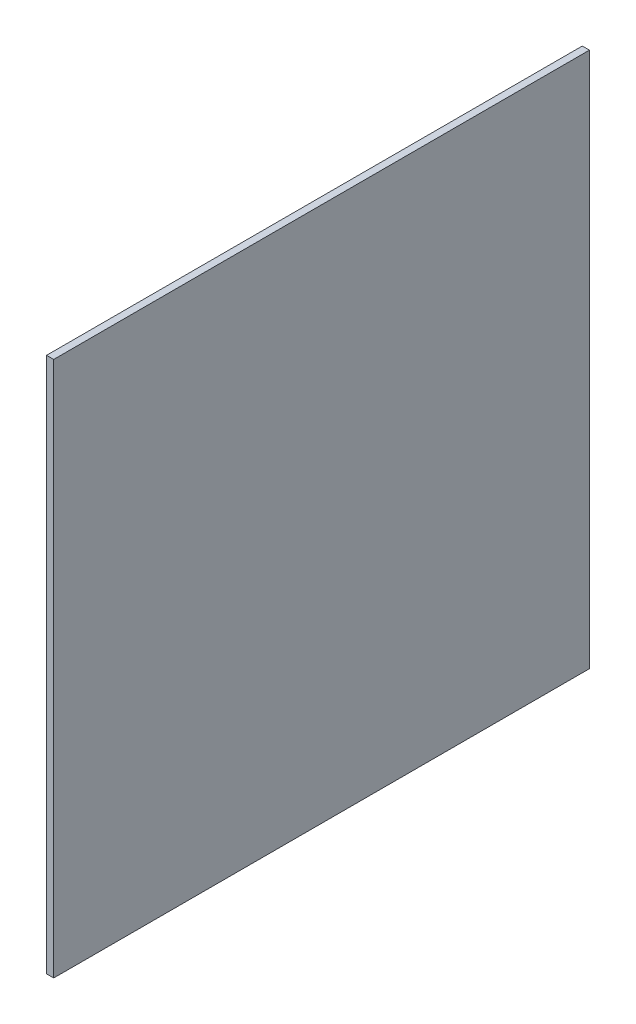
ISO-10303-21;
HEADER;
FILE_DESCRIPTION(('STEP AP214'),'2;1');
FILE_NAME('part.step','',(''),(''),'','','');
FILE_SCHEMA(('AUTOMOTIVE_DESIGN { 1 0 10303 214 1 1 1 1 }'));
ENDSEC;
DATA;
#1=APPLICATION_CONTEXT('core data for automotive mechanical design processes');
#2=APPLICATION_PROTOCOL_DEFINITION('international standard','automotive_design',2000,#1);
#3=PRODUCT_CONTEXT('',#1,'mechanical');
#4=PRODUCT('Part','Part','',(#3));
#5=PRODUCT_RELATED_PRODUCT_CATEGORY('part','',(#4));
#6=PRODUCT_DEFINITION_FORMATION('','',#4);
#7=PRODUCT_DEFINITION_CONTEXT('part definition',#1,'design');
#8=PRODUCT_DEFINITION('design','',#6,#7);
#9=PRODUCT_DEFINITION_SHAPE('','',#8);
#10=(LENGTH_UNIT() NAMED_UNIT(*) SI_UNIT(.MILLI.,.METRE.));
#11=(NAMED_UNIT(*) PLANE_ANGLE_UNIT() SI_UNIT($,.RADIAN.));
#12=(NAMED_UNIT(*) SI_UNIT($,.STERADIAN.) SOLID_ANGLE_UNIT());
#13=UNCERTAINTY_MEASURE_WITH_UNIT(LENGTH_MEASURE(1.E-05),#10,'distance_accuracy_value','');
#14=(GEOMETRIC_REPRESENTATION_CONTEXT(3) GLOBAL_UNCERTAINTY_ASSIGNED_CONTEXT((#13)) GLOBAL_UNIT_ASSIGNED_CONTEXT((#10,
#11,#12)) REPRESENTATION_CONTEXT('',''));
#15=CARTESIAN_POINT('',(0.,0.,0.));
#16=DIRECTION('',(0.,0.,1.));
#17=DIRECTION('',(1.,0.,0.));
#18=AXIS2_PLACEMENT_3D('',#15,#16,#17);
#19=CARTESIAN_POINT('',(-75.,-75.,150.));
#20=DIRECTION('',(1.,0.,0.));
#21=DIRECTION('',(0.,0.,-1.));
#22=AXIS2_PLACEMENT_3D('',#19,#20,#21);
#23=PLANE('',#22);
#24=DIRECTION('',(0.,-1.,0.));
#25=VECTOR('',#24,1.);
#26=CARTESIAN_POINT('',(-75.,-75.,0.));
#27=LINE('',#26,#25);
#28=CARTESIAN_POINT('',(-75.,75.,0.));
#29=VERTEX_POINT('',#28);
#30=CARTESIAN_POINT('',(-75.,-75.,0.));
#31=VERTEX_POINT('',#30);
#32=EDGE_CURVE('E95',#29,#31,#27,.T.);
#33=ORIENTED_EDGE('',*,*,#32,.T.);
#34=DIRECTION('',(0.,0.,-1.));
#35=VECTOR('',#34,1.);
#36=CARTESIAN_POINT('',(-75.,-75.,150.));
#37=LINE('',#36,#35);
#38=CARTESIAN_POINT('',(-75.,-75.,150.));
#39=VERTEX_POINT('',#38);
#40=EDGE_CURVE('E11',#39,#31,#37,.T.);
#41=ORIENTED_EDGE('',*,*,#40,.F.);
#42=DIRECTION('',(0.,-1.,0.));
#43=VECTOR('',#42,1.);
#44=CARTESIAN_POINT('',(-75.,-75.,150.));
#45=LINE('',#44,#43);
#46=CARTESIAN_POINT('',(-75.,75.,150.));
#47=VERTEX_POINT('',#46);
#48=EDGE_CURVE('E83',#47,#39,#45,.T.);
#49=ORIENTED_EDGE('',*,*,#48,.F.);
#50=DIRECTION('',(0.,0.,-1.));
#51=VECTOR('',#50,1.);
#52=CARTESIAN_POINT('',(-75.,75.,150.));
#53=LINE('',#52,#51);
#54=EDGE_CURVE('E91',#47,#29,#53,.T.);
#55=ORIENTED_EDGE('',*,*,#54,.T.);
#56=EDGE_LOOP('',(#33,#41,#49,#55));
#57=FACE_BOUND('',#56,.T.);
#58=ADVANCED_FACE('F32',(#57),#23,.F.);
#59=CARTESIAN_POINT('',(-75.,-75.,150.));
#60=DIRECTION('',(0.,1.,0.));
#61=DIRECTION('',(0.,0.,1.));
#62=AXIS2_PLACEMENT_3D('',#59,#60,#61);
#63=PLANE('',#62);
#64=DIRECTION('',(1.,0.,0.));
#65=VECTOR('',#64,1.);
#66=CARTESIAN_POINT('',(-75.,-75.,0.));
#67=LINE('',#66,#65);
#68=CARTESIAN_POINT('',(-73.,-75.,0.));
#69=VERTEX_POINT('',#68);
#70=EDGE_CURVE('E87',#31,#69,#67,.T.);
#71=ORIENTED_EDGE('',*,*,#70,.T.);
#72=DIRECTION('',(0.,0.,-1.));
#73=VECTOR('',#72,1.);
#74=CARTESIAN_POINT('',(-73.,-75.,150.));
#75=LINE('',#74,#73);
#76=CARTESIAN_POINT('',(-73.,-75.,150.));
#77=VERTEX_POINT('',#76);
#78=EDGE_CURVE('E40',#77,#69,#75,.T.);
#79=ORIENTED_EDGE('',*,*,#78,.F.);
#80=DIRECTION('',(1.,0.,0.));
#81=VECTOR('',#80,1.);
#82=CARTESIAN_POINT('',(-75.,-75.,150.));
#83=LINE('',#82,#81);
#84=EDGE_CURVE('E78',#39,#77,#83,.T.);
#85=ORIENTED_EDGE('',*,*,#84,.F.);
#86=ORIENTED_EDGE('',*,*,#40,.T.);
#87=EDGE_LOOP('',(#71,#79,#85,#86));
#88=FACE_BOUND('',#87,.T.);
#89=ADVANCED_FACE('F86',(#88),#63,.F.);
#90=CARTESIAN_POINT('',(-73.,-75.,150.));
#91=DIRECTION('',(-1.,0.,0.));
#92=DIRECTION('',(0.,0.,1.));
#93=AXIS2_PLACEMENT_3D('',#90,#91,#92);
#94=PLANE('',#93);
#95=DIRECTION('',(0.,1.,0.));
#96=VECTOR('',#95,1.);
#97=CARTESIAN_POINT('',(-73.,-75.,0.));
#98=LINE('',#97,#96);
#99=CARTESIAN_POINT('',(-73.,75.,0.));
#100=VERTEX_POINT('',#99);
#101=EDGE_CURVE('E65',#69,#100,#98,.T.);
#102=ORIENTED_EDGE('',*,*,#101,.T.);
#103=DIRECTION('',(0.,0.,-1.));
#104=VECTOR('',#103,1.);
#105=CARTESIAN_POINT('',(-73.,75.,150.));
#106=LINE('',#105,#104);
#107=CARTESIAN_POINT('',(-73.,75.,150.));
#108=VERTEX_POINT('',#107);
#109=EDGE_CURVE('E88',#108,#100,#106,.T.);
#110=ORIENTED_EDGE('',*,*,#109,.F.);
#111=DIRECTION('',(0.,1.,0.));
#112=VECTOR('',#111,1.);
#113=CARTESIAN_POINT('',(-73.,-75.,150.));
#114=LINE('',#113,#112);
#115=EDGE_CURVE('E81',#77,#108,#114,.T.);
#116=ORIENTED_EDGE('',*,*,#115,.F.);
#117=ORIENTED_EDGE('',*,*,#78,.T.);
#118=EDGE_LOOP('',(#102,#110,#116,#117));
#119=FACE_BOUND('',#118,.T.);
#120=ADVANCED_FACE('F89',(#119),#94,.F.);
#121=CARTESIAN_POINT('',(-75.,75.,150.));
#122=DIRECTION('',(0.,-1.,0.));
#123=DIRECTION('',(0.,0.,-1.));
#124=AXIS2_PLACEMENT_3D('',#121,#122,#123);
#125=PLANE('',#124);
#126=DIRECTION('',(-1.,0.,0.));
#127=VECTOR('',#126,1.);
#128=CARTESIAN_POINT('',(-75.,75.,0.));
#129=LINE('',#128,#127);
#130=EDGE_CURVE('E71',#100,#29,#129,.T.);
#131=ORIENTED_EDGE('',*,*,#130,.T.);
#132=ORIENTED_EDGE('',*,*,#54,.F.);
#133=DIRECTION('',(-1.,0.,0.));
#134=VECTOR('',#133,1.);
#135=CARTESIAN_POINT('',(-75.,75.,150.));
#136=LINE('',#135,#134);
#137=EDGE_CURVE('E48',#108,#47,#136,.T.);
#138=ORIENTED_EDGE('',*,*,#137,.F.);
#139=ORIENTED_EDGE('',*,*,#109,.T.);
#140=EDGE_LOOP('',(#131,#132,#138,#139));
#141=FACE_BOUND('',#140,.T.);
#142=ADVANCED_FACE('F102',(#141),#125,.F.);
#143=CARTESIAN_POINT('',(0.,0.,150.));
#144=DIRECTION('',(0.,0.,-1.));
#145=DIRECTION('',(-1.,0.,0.));
#146=AXIS2_PLACEMENT_3D('',#143,#144,#145);
#147=PLANE('',#146);
#148=ORIENTED_EDGE('',*,*,#48,.T.);
#149=ORIENTED_EDGE('',*,*,#84,.T.);
#150=ORIENTED_EDGE('',*,*,#115,.T.);
#151=ORIENTED_EDGE('',*,*,#137,.T.);
#152=EDGE_LOOP('',(#148,#149,#150,#151));
#153=FACE_BOUND('',#152,.T.);
#154=ADVANCED_FACE('F79',(#153),#147,.F.);
#155=CARTESIAN_POINT('',(0.,0.,0.));
#156=DIRECTION('',(0.,0.,-1.));
#157=DIRECTION('',(-1.,0.,0.));
#158=AXIS2_PLACEMENT_3D('',#155,#156,#157);
#159=PLANE('',#158);
#160=ORIENTED_EDGE('',*,*,#32,.F.);
#161=ORIENTED_EDGE('',*,*,#130,.F.);
#162=ORIENTED_EDGE('',*,*,#101,.F.);
#163=ORIENTED_EDGE('',*,*,#70,.F.);
#164=EDGE_LOOP('',(#160,#161,#162,#163));
#165=FACE_BOUND('',#164,.T.);
#166=ADVANCED_FACE('F105',(#165),#159,.T.);
#167=CLOSED_SHELL('',(#58,#89,#120,#142,#154,#166));
#168=MANIFOLD_SOLID_BREP('B2',#167);
#169=ADVANCED_BREP_SHAPE_REPRESENTATION('',(#18,#168),#14);
#170=SHAPE_DEFINITION_REPRESENTATION(#9,#169);
ENDSEC;
END-ISO-10303-21;
